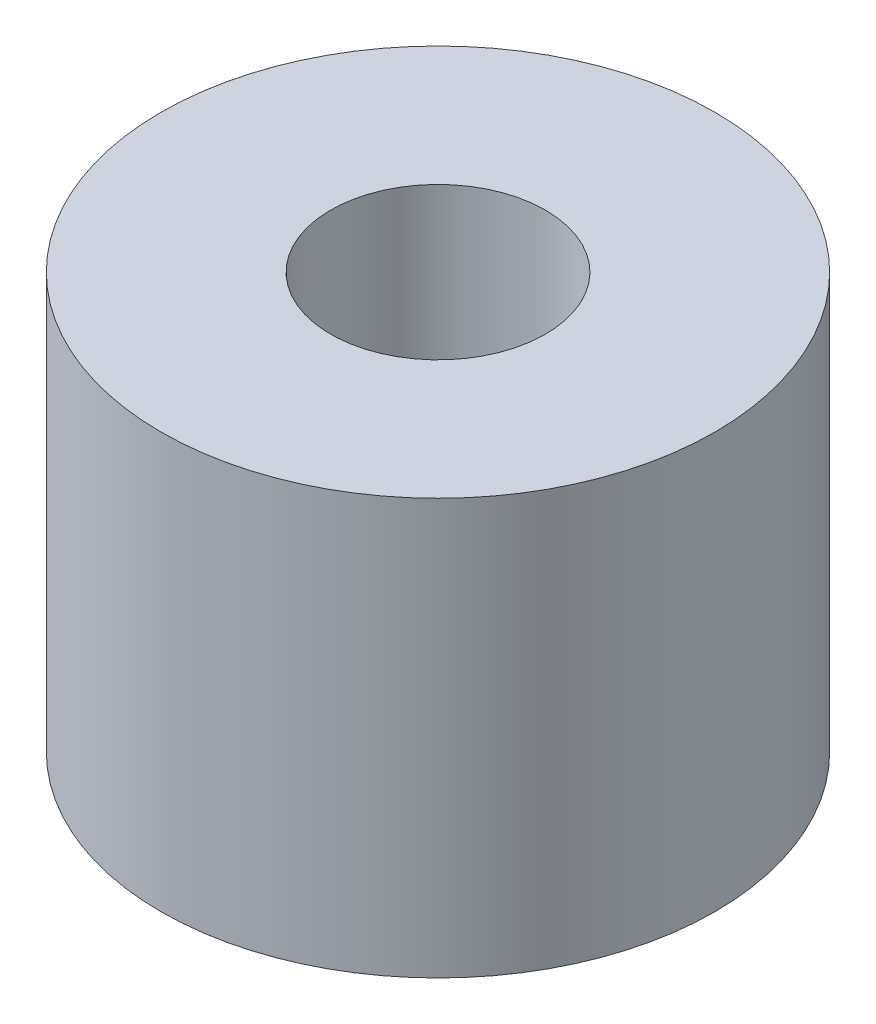
ISO-10303-21;
HEADER;
FILE_DESCRIPTION(('STEP AP214'),'2;1');
FILE_NAME('part.step','',(''),(''),'','','');
FILE_SCHEMA(('AUTOMOTIVE_DESIGN { 1 0 10303 214 1 1 1 1 }'));
ENDSEC;
DATA;
#1=APPLICATION_CONTEXT('core data for automotive mechanical design processes');
#2=APPLICATION_PROTOCOL_DEFINITION('international standard','automotive_design',2000,#1);
#3=PRODUCT_CONTEXT('',#1,'mechanical');
#4=PRODUCT('Part','Part','',(#3));
#5=PRODUCT_RELATED_PRODUCT_CATEGORY('part','',(#4));
#6=PRODUCT_DEFINITION_FORMATION('','',#4);
#7=PRODUCT_DEFINITION_CONTEXT('part definition',#1,'design');
#8=PRODUCT_DEFINITION('design','',#6,#7);
#9=PRODUCT_DEFINITION_SHAPE('','',#8);
#10=(LENGTH_UNIT() NAMED_UNIT(*) SI_UNIT(.MILLI.,.METRE.));
#11=(NAMED_UNIT(*) PLANE_ANGLE_UNIT() SI_UNIT($,.RADIAN.));
#12=(NAMED_UNIT(*) SI_UNIT($,.STERADIAN.) SOLID_ANGLE_UNIT());
#13=UNCERTAINTY_MEASURE_WITH_UNIT(LENGTH_MEASURE(1.E-05),#10,'distance_accuracy_value','');
#14=(GEOMETRIC_REPRESENTATION_CONTEXT(3) GLOBAL_UNCERTAINTY_ASSIGNED_CONTEXT((#13)) GLOBAL_UNIT_ASSIGNED_CONTEXT((#10,
#11,#12)) REPRESENTATION_CONTEXT('',''));
#15=CARTESIAN_POINT('',(0.,0.,0.));
#16=DIRECTION('',(0.,0.,1.));
#17=DIRECTION('',(1.,0.,0.));
#18=AXIS2_PLACEMENT_3D('',#15,#16,#17);
#19=CARTESIAN_POINT('',(0.,4.7625,0.));
#20=DIRECTION('',(0.,-1.,0.));
#21=DIRECTION('',(0.,0.,-1.));
#22=AXIS2_PLACEMENT_3D('',#19,#20,#21);
#23=CYLINDRICAL_SURFACE('',#22,2.4638);
#24=CARTESIAN_POINT('',(0.,-4.7625,0.));
#25=DIRECTION('',(0.,-1.,0.));
#26=DIRECTION('',(0.,0.,-1.));
#27=AXIS2_PLACEMENT_3D('',#24,#25,#26);
#28=CIRCLE('',#27,2.4638);
#29=CARTESIAN_POINT('',(0.,-4.7625,-2.4638));
#30=VERTEX_POINT('',#29);
#31=EDGE_CURVE('E26',#30,#30,#28,.T.);
#32=ORIENTED_EDGE('',*,*,#31,.T.);
#33=EDGE_LOOP('',(#32));
#34=FACE_BOUND('',#33,.T.);
#35=CARTESIAN_POINT('',(0.,4.7625,0.));
#36=DIRECTION('',(0.,-1.,0.));
#37=DIRECTION('',(0.,0.,-1.));
#38=AXIS2_PLACEMENT_3D('',#35,#36,#37);
#39=CIRCLE('',#38,2.4638);
#40=CARTESIAN_POINT('',(0.,4.7625,-2.4638));
#41=VERTEX_POINT('',#40);
#42=EDGE_CURVE('E17',#41,#41,#39,.T.);
#43=ORIENTED_EDGE('',*,*,#42,.F.);
#44=EDGE_LOOP('',(#43));
#45=FACE_BOUND('',#44,.T.);
#46=ADVANCED_FACE('F14',(#34,#45),#23,.F.);
#47=CARTESIAN_POINT('',(0.,4.7625,0.));
#48=DIRECTION('',(0.,1.,0.));
#49=DIRECTION('',(0.,0.,1.));
#50=AXIS2_PLACEMENT_3D('',#47,#48,#49);
#51=PLANE('',#50);
#52=ORIENTED_EDGE('',*,*,#42,.T.);
#53=EDGE_LOOP('',(#52));
#54=FACE_BOUND('',#53,.T.);
#55=CARTESIAN_POINT('',(0.,4.7625,0.));
#56=DIRECTION('',(0.,-1.,0.));
#57=DIRECTION('',(0.,0.,-1.));
#58=AXIS2_PLACEMENT_3D('',#55,#56,#57);
#59=CIRCLE('',#58,6.35);
#60=CARTESIAN_POINT('',(0.,4.7625,-6.35));
#61=VERTEX_POINT('',#60);
#62=EDGE_CURVE('E21',#61,#61,#59,.T.);
#63=ORIENTED_EDGE('',*,*,#62,.F.);
#64=EDGE_LOOP('',(#63));
#65=FACE_BOUND('',#64,.T.);
#66=ADVANCED_FACE('F34',(#54,#65),#51,.T.);
#67=CARTESIAN_POINT('',(0.,-4.7625,0.));
#68=DIRECTION('',(0.,1.,0.));
#69=DIRECTION('',(0.,0.,1.));
#70=AXIS2_PLACEMENT_3D('',#67,#68,#69);
#71=PLANE('',#70);
#72=ORIENTED_EDGE('',*,*,#31,.F.);
#73=EDGE_LOOP('',(#72));
#74=FACE_BOUND('',#73,.T.);
#75=CARTESIAN_POINT('',(0.,-4.7625,0.));
#76=DIRECTION('',(0.,-1.,0.));
#77=DIRECTION('',(0.,0.,-1.));
#78=AXIS2_PLACEMENT_3D('',#75,#76,#77);
#79=CIRCLE('',#78,6.35);
#80=CARTESIAN_POINT('',(0.,-4.7625,-6.35));
#81=VERTEX_POINT('',#80);
#82=EDGE_CURVE('E9',#81,#81,#79,.F.);
#83=ORIENTED_EDGE('',*,*,#82,.F.);
#84=EDGE_LOOP('',(#83));
#85=FACE_BOUND('',#84,.T.);
#86=ADVANCED_FACE('F42',(#74,#85),#71,.F.);
#87=CARTESIAN_POINT('',(0.,4.7625,0.));
#88=DIRECTION('',(0.,-1.,0.));
#89=DIRECTION('',(0.,0.,-1.));
#90=AXIS2_PLACEMENT_3D('',#87,#88,#89);
#91=CYLINDRICAL_SURFACE('',#90,6.35);
#92=ORIENTED_EDGE('',*,*,#82,.T.);
#93=EDGE_LOOP('',(#92));
#94=FACE_BOUND('',#93,.T.);
#95=ORIENTED_EDGE('',*,*,#62,.T.);
#96=EDGE_LOOP('',(#95));
#97=FACE_BOUND('',#96,.T.);
#98=ADVANCED_FACE('F43',(#94,#97),#91,.T.);
#99=CLOSED_SHELL('',(#46,#66,#86,#98));
#100=MANIFOLD_SOLID_BREP('B1',#99);
#101=ADVANCED_BREP_SHAPE_REPRESENTATION('',(#18,#100),#14);
#102=SHAPE_DEFINITION_REPRESENTATION(#9,#101);
ENDSEC;
END-ISO-10303-21;
